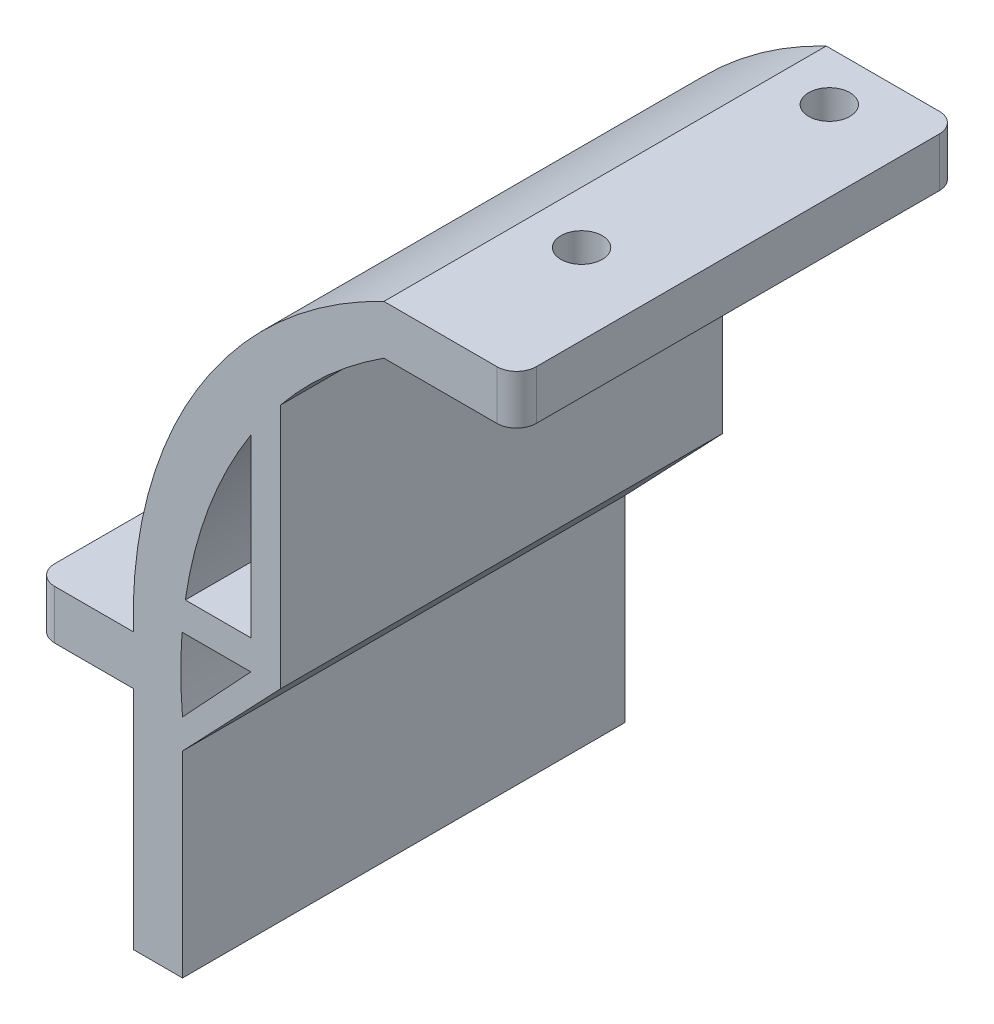
ISO-10303-21;
HEADER;
FILE_DESCRIPTION(('STEP AP214'),'2;1');
FILE_NAME('part.step','',(''),(''),'','','');
FILE_SCHEMA(('AUTOMOTIVE_DESIGN { 1 0 10303 214 1 1 1 1 }'));
ENDSEC;
DATA;
#1=APPLICATION_CONTEXT('core data for automotive mechanical design processes');
#2=APPLICATION_PROTOCOL_DEFINITION('international standard','automotive_design',2000,#1);
#3=PRODUCT_CONTEXT('',#1,'mechanical');
#4=PRODUCT('Part','Part','',(#3));
#5=PRODUCT_RELATED_PRODUCT_CATEGORY('part','',(#4));
#6=PRODUCT_DEFINITION_FORMATION('','',#4);
#7=PRODUCT_DEFINITION_CONTEXT('part definition',#1,'design');
#8=PRODUCT_DEFINITION('design','',#6,#7);
#9=PRODUCT_DEFINITION_SHAPE('','',#8);
#10=(LENGTH_UNIT() NAMED_UNIT(*) SI_UNIT(.MILLI.,.METRE.));
#11=(NAMED_UNIT(*) PLANE_ANGLE_UNIT() SI_UNIT($,.RADIAN.));
#12=(NAMED_UNIT(*) SI_UNIT($,.STERADIAN.) SOLID_ANGLE_UNIT());
#13=UNCERTAINTY_MEASURE_WITH_UNIT(LENGTH_MEASURE(1.E-05),#10,'distance_accuracy_value','');
#14=(GEOMETRIC_REPRESENTATION_CONTEXT(3) GLOBAL_UNCERTAINTY_ASSIGNED_CONTEXT((#13)) GLOBAL_UNIT_ASSIGNED_CONTEXT((#10,
#11,#12)) REPRESENTATION_CONTEXT('',''));
#15=CARTESIAN_POINT('',(0.,0.,0.));
#16=DIRECTION('',(0.,0.,1.));
#17=DIRECTION('',(1.,0.,0.));
#18=AXIS2_PLACEMENT_3D('',#15,#16,#17);
#19=CARTESIAN_POINT('',(19.2704077275692,219.412639915224,45.));
#20=DIRECTION('',(0.,0.,-1.));
#21=DIRECTION('',(-1.,0.,0.));
#22=AXIS2_PLACEMENT_3D('',#19,#20,#21);
#23=CYLINDRICAL_SURFACE('',#22,45.);
#24=DIRECTION('',(0.,0.,1.));
#25=VECTOR('',#24,1.);
#26=CARTESIAN_POINT('',(-18.5973694260722,243.723778379767,0.));
#27=LINE('',#26,#25);
#28=CARTESIAN_POINT('',(-18.5973694260722,243.723778379767,0.));
#29=VERTEX_POINT('',#28);
#30=CARTESIAN_POINT('',(-18.5973694260722,243.723778379767,45.));
#31=VERTEX_POINT('',#30);
#32=EDGE_CURVE('E225',#29,#31,#27,.T.);
#33=ORIENTED_EDGE('',*,*,#32,.T.);
#34=CARTESIAN_POINT('',(19.2704077275692,219.412639915224,45.));
#35=DIRECTION('',(0.,0.,1.));
#36=DIRECTION('',(1.,0.,0.));
#37=AXIS2_PLACEMENT_3D('',#34,#35,#36);
#38=CIRCLE('',#37,45.);
#39=CARTESIAN_POINT('',(-25.2653617340679,225.859750776681,45.));
#40=VERTEX_POINT('',#39);
#41=EDGE_CURVE('E308',#31,#40,#38,.T.);
#42=ORIENTED_EDGE('',*,*,#41,.T.);
#43=DIRECTION('',(0.,0.,1.));
#44=VECTOR('',#43,1.);
#45=CARTESIAN_POINT('',(-25.2653617340679,225.859750776681,0.));
#46=LINE('',#45,#44);
#47=CARTESIAN_POINT('',(-25.2653617340679,225.859750776681,0.));
#48=VERTEX_POINT('',#47);
#49=EDGE_CURVE('E211',#48,#40,#46,.T.);
#50=ORIENTED_EDGE('',*,*,#49,.F.);
#51=CARTESIAN_POINT('',(19.2704077275692,219.412639915224,0.));
#52=DIRECTION('',(0.,0.,1.));
#53=DIRECTION('',(1.,0.,0.));
#54=AXIS2_PLACEMENT_3D('',#51,#52,#53);
#55=CIRCLE('',#54,45.);
#56=EDGE_CURVE('E220',#29,#48,#55,.T.);
#57=ORIENTED_EDGE('',*,*,#56,.F.);
#58=EDGE_LOOP('',(#33,#42,#50,#57));
#59=FACE_BOUND('',#58,.T.);
#60=ADVANCED_FACE('F41',(#59),#23,.F.);
#61=DIRECTION('',(0.,0.,1.));
#62=VECTOR('',#61,1.);
#63=CARTESIAN_POINT('',(-25.5973694260722,222.859750776681,0.));
#64=LINE('',#63,#62);
#65=CARTESIAN_POINT('',(-25.5973694260722,222.859750776681,0.));
#66=VERTEX_POINT('',#65);
#67=CARTESIAN_POINT('',(-25.5973694260722,222.859750776681,45.));
#68=VERTEX_POINT('',#67);
#69=EDGE_CURVE('E273',#66,#68,#64,.T.);
#70=ORIENTED_EDGE('',*,*,#69,.T.);
#71=CARTESIAN_POINT('',(-25.5516147708674,215.414352888303,45.));
#72=VERTEX_POINT('',#71);
#73=EDGE_CURVE('E309',#68,#72,#38,.T.);
#74=ORIENTED_EDGE('',*,*,#73,.T.);
#75=DIRECTION('',(0.,0.,-1.));
#76=VECTOR('',#75,1.);
#77=CARTESIAN_POINT('',(-25.5516147708674,215.414352888303,45.));
#78=LINE('',#77,#76);
#79=CARTESIAN_POINT('',(-25.5516147708674,215.414352888303,0.));
#80=VERTEX_POINT('',#79);
#81=EDGE_CURVE('E335',#72,#80,#78,.T.);
#82=ORIENTED_EDGE('',*,*,#81,.T.);
#83=EDGE_CURVE('E341',#66,#80,#55,.T.);
#84=ORIENTED_EDGE('',*,*,#83,.F.);
#85=EDGE_LOOP('',(#70,#74,#82,#84));
#86=FACE_BOUND('',#85,.T.);
#87=ADVANCED_FACE('F485',(#86),#23,.F.);
#88=CARTESIAN_POINT('',(-25.5516147708674,0.,45.));
#89=DIRECTION('',(1.,0.,0.));
#90=DIRECTION('',(0.,0.,-1.));
#91=AXIS2_PLACEMENT_3D('',#88,#89,#90);
#92=PLANE('',#91);
#93=DIRECTION('',(0.,-1.,0.));
#94=VECTOR('',#93,1.);
#95=CARTESIAN_POINT('',(-25.5516147708674,0.,0.));
#96=LINE('',#95,#94);
#97=CARTESIAN_POINT('',(-25.5516147708674,212.414352888303,0.));
#98=VERTEX_POINT('',#97);
#99=CARTESIAN_POINT('',(-25.5516147708674,192.414352888303,0.));
#100=VERTEX_POINT('',#99);
#101=EDGE_CURVE('E364',#98,#100,#96,.T.);
#102=ORIENTED_EDGE('',*,*,#101,.F.);
#103=DIRECTION('',(0.,0.,1.));
#104=VECTOR('',#103,1.);
#105=CARTESIAN_POINT('',(-25.5516147708674,212.414352888303,0.));
#106=LINE('',#105,#104);
#107=CARTESIAN_POINT('',(-25.5516147708674,212.414352888303,45.));
#108=VERTEX_POINT('',#107);
#109=EDGE_CURVE('E59',#98,#108,#106,.T.);
#110=ORIENTED_EDGE('',*,*,#109,.T.);
#111=DIRECTION('',(0.,-1.,0.));
#112=VECTOR('',#111,1.);
#113=CARTESIAN_POINT('',(-25.5516147708674,0.,45.));
#114=LINE('',#113,#112);
#115=CARTESIAN_POINT('',(-25.5516147708674,192.414352888303,45.));
#116=VERTEX_POINT('',#115);
#117=EDGE_CURVE('E332',#108,#116,#114,.T.);
#118=ORIENTED_EDGE('',*,*,#117,.T.);
#119=DIRECTION('',(0.,0.,-1.));
#120=VECTOR('',#119,1.);
#121=CARTESIAN_POINT('',(-25.5516147708674,192.414352888303,45.));
#122=LINE('',#121,#120);
#123=EDGE_CURVE('E370',#116,#100,#122,.T.);
#124=ORIENTED_EDGE('',*,*,#123,.T.);
#125=EDGE_LOOP('',(#102,#110,#118,#124));
#126=FACE_BOUND('',#125,.T.);
#127=ADVANCED_FACE('F506',(#126),#92,.T.);
#128=DIRECTION('',(0.,0.,1.));
#129=VECTOR('',#128,1.);
#130=CARTESIAN_POINT('',(-15.5973694260722,247.859750776681,0.));
#131=LINE('',#130,#129);
#132=CARTESIAN_POINT('',(-15.5973694260722,247.859750776681,0.));
#133=VERTEX_POINT('',#132);
#134=CARTESIAN_POINT('',(-15.5973694260722,247.859750776681,45.));
#135=VERTEX_POINT('',#134);
#136=EDGE_CURVE('E262',#133,#135,#131,.T.);
#137=ORIENTED_EDGE('',*,*,#136,.F.);
#138=CARTESIAN_POINT('',(-5.06519953005821,257.264696918807,0.));
#139=VERTEX_POINT('',#138);
#140=EDGE_CURVE('E336',#139,#133,#55,.T.);
#141=ORIENTED_EDGE('',*,*,#140,.F.);
#142=DIRECTION('',(0.,0.,-1.));
#143=VECTOR('',#142,1.);
#144=CARTESIAN_POINT('',(-5.06519953005821,257.264696918807,45.));
#145=LINE('',#144,#143);
#146=CARTESIAN_POINT('',(-5.06519953005821,257.264696918807,45.));
#147=VERTEX_POINT('',#146);
#148=EDGE_CURVE('E406',#147,#139,#145,.T.);
#149=ORIENTED_EDGE('',*,*,#148,.F.);
#150=EDGE_CURVE('E303',#147,#135,#38,.T.);
#151=ORIENTED_EDGE('',*,*,#150,.T.);
#152=EDGE_LOOP('',(#137,#141,#149,#151));
#153=FACE_BOUND('',#152,.T.);
#154=ADVANCED_FACE('F502',(#153),#23,.F.);
#155=CARTESIAN_POINT('',(0.,257.264696918807,45.));
#156=DIRECTION('',(0.,-1.,0.));
#157=DIRECTION('',(0.,0.,-1.));
#158=AXIS2_PLACEMENT_3D('',#155,#156,#157);
#159=PLANE('',#158);
#160=CARTESIAN_POINT('',(0.244800469941791,257.264696918807,5.));
#161=DIRECTION('',(0.,-1.,0.));
#162=DIRECTION('',(0.,0.,-1.));
#163=AXIS2_PLACEMENT_3D('',#160,#161,#162);
#164=CIRCLE('',#163,2.1);
#165=CARTESIAN_POINT('',(0.244800469941791,257.264696918807,2.9));
#166=VERTEX_POINT('',#165);
#167=EDGE_CURVE('E290',#166,#166,#164,.T.);
#168=ORIENTED_EDGE('',*,*,#167,.F.);
#169=EDGE_LOOP('',(#168));
#170=FACE_BOUND('',#169,.T.);
#171=CARTESIAN_POINT('',(0.244800469941791,257.264696918807,30.2));
#172=DIRECTION('',(0.,-1.,0.));
#173=DIRECTION('',(0.,0.,-1.));
#174=AXIS2_PLACEMENT_3D('',#171,#172,#173);
#175=CIRCLE('',#174,2.1);
#176=CARTESIAN_POINT('',(0.244800469941791,257.264696918807,28.1));
#177=VERTEX_POINT('',#176);
#178=EDGE_CURVE('E283',#177,#177,#175,.T.);
#179=ORIENTED_EDGE('',*,*,#178,.F.);
#180=EDGE_LOOP('',(#179));
#181=FACE_BOUND('',#180,.T.);
#182=DIRECTION('',(-1.,0.,0.));
#183=VECTOR('',#182,1.);
#184=CARTESIAN_POINT('',(0.,257.264696918807,0.));
#185=LINE('',#184,#183);
#186=CARTESIAN_POINT('',(6.43480046994179,257.264696918807,0.));
#187=VERTEX_POINT('',#186);
#188=EDGE_CURVE('E340',#187,#139,#185,.T.);
#189=ORIENTED_EDGE('',*,*,#188,.F.);
#190=CARTESIAN_POINT('',(6.43480046994179,257.264696918807,2.));
#191=DIRECTION('',(0.,-1.,0.));
#192=DIRECTION('',(0.,0.,-1.));
#193=AXIS2_PLACEMENT_3D('',#190,#191,#192);
#194=CIRCLE('',#193,2.);
#195=CARTESIAN_POINT('',(8.43480046994179,257.264696918807,2.00000000000002));
#196=VERTEX_POINT('',#195);
#197=EDGE_CURVE('E446',#187,#196,#194,.T.);
#198=ORIENTED_EDGE('',*,*,#197,.T.);
#199=DIRECTION('',(0.,0.,-1.));
#200=VECTOR('',#199,1.);
#201=CARTESIAN_POINT('',(8.43480046994179,257.264696918807,45.));
#202=LINE('',#201,#200);
#203=CARTESIAN_POINT('',(8.43480046994179,257.264696918807,43.));
#204=VERTEX_POINT('',#203);
#205=EDGE_CURVE('E402',#204,#196,#202,.T.);
#206=ORIENTED_EDGE('',*,*,#205,.F.);
#207=CARTESIAN_POINT('',(6.43480046994179,257.264696918807,43.));
#208=DIRECTION('',(0.,-1.,0.));
#209=DIRECTION('',(0.,0.,-1.));
#210=AXIS2_PLACEMENT_3D('',#207,#208,#209);
#211=CIRCLE('',#210,2.);
#212=CARTESIAN_POINT('',(6.43480046994179,257.264696918807,45.));
#213=VERTEX_POINT('',#212);
#214=EDGE_CURVE('E443',#204,#213,#211,.T.);
#215=ORIENTED_EDGE('',*,*,#214,.T.);
#216=DIRECTION('',(-1.,0.,0.));
#217=VECTOR('',#216,1.);
#218=CARTESIAN_POINT('',(0.,257.264696918807,45.));
#219=LINE('',#218,#217);
#220=EDGE_CURVE('E307',#213,#147,#219,.T.);
#221=ORIENTED_EDGE('',*,*,#220,.T.);
#222=ORIENTED_EDGE('',*,*,#148,.T.);
#223=EDGE_LOOP('',(#189,#198,#206,#215,#221,#222));
#224=FACE_BOUND('',#223,.T.);
#225=ADVANCED_FACE('F509',(#170,#181,#224),#159,.T.);
#226=CARTESIAN_POINT('',(8.43480046994179,0.,45.));
#227=DIRECTION('',(1.,0.,0.));
#228=DIRECTION('',(0.,0.,-1.));
#229=AXIS2_PLACEMENT_3D('',#226,#227,#228);
#230=PLANE('',#229);
#231=ORIENTED_EDGE('',*,*,#205,.T.);
#232=DIRECTION('',(0.,-1.,0.));
#233=VECTOR('',#232,1.);
#234=CARTESIAN_POINT('',(8.43480046994179,262.264696918807,2.));
#235=LINE('',#234,#233);
#236=CARTESIAN_POINT('',(8.43480046994179,262.264696918807,2.00000000000002));
#237=VERTEX_POINT('',#236);
#238=EDGE_CURVE('E453',#196,#237,#235,.F.);
#239=ORIENTED_EDGE('',*,*,#238,.T.);
#240=DIRECTION('',(0.,0.,-1.));
#241=VECTOR('',#240,1.);
#242=CARTESIAN_POINT('',(8.43480046994179,262.264696918807,45.));
#243=LINE('',#242,#241);
#244=CARTESIAN_POINT('',(8.43480046994179,262.264696918807,43.));
#245=VERTEX_POINT('',#244);
#246=EDGE_CURVE('E398',#245,#237,#243,.T.);
#247=ORIENTED_EDGE('',*,*,#246,.F.);
#248=DIRECTION('',(0.,-1.,0.));
#249=VECTOR('',#248,1.);
#250=CARTESIAN_POINT('',(8.43480046994179,0.,43.));
#251=LINE('',#250,#249);
#252=EDGE_CURVE('E449',#245,#204,#251,.T.);
#253=ORIENTED_EDGE('',*,*,#252,.T.);
#254=EDGE_LOOP('',(#231,#239,#247,#253));
#255=FACE_BOUND('',#254,.T.);
#256=ADVANCED_FACE('F515',(#255),#230,.T.);
#257=CARTESIAN_POINT('',(0.,262.264696918807,45.));
#258=DIRECTION('',(0.,-1.,0.));
#259=DIRECTION('',(0.,0.,-1.));
#260=AXIS2_PLACEMENT_3D('',#257,#258,#259);
#261=PLANE('',#260);
#262=CARTESIAN_POINT('',(0.244800469941791,262.264696918807,5.));
#263=DIRECTION('',(0.,1.,0.));
#264=DIRECTION('',(0.,0.,1.));
#265=AXIS2_PLACEMENT_3D('',#262,#263,#264);
#266=CIRCLE('',#265,2.1);
#267=CARTESIAN_POINT('',(0.244800469941791,262.264696918807,7.1));
#268=VERTEX_POINT('',#267);
#269=EDGE_CURVE('E279',#268,#268,#266,.T.);
#270=ORIENTED_EDGE('',*,*,#269,.F.);
#271=EDGE_LOOP('',(#270));
#272=FACE_BOUND('',#271,.T.);
#273=CARTESIAN_POINT('',(0.244800469941791,262.264696918807,30.2));
#274=DIRECTION('',(0.,1.,0.));
#275=DIRECTION('',(0.,0.,1.));
#276=AXIS2_PLACEMENT_3D('',#273,#274,#275);
#277=CIRCLE('',#276,2.1);
#278=CARTESIAN_POINT('',(0.244800469941791,262.264696918807,32.3));
#279=VERTEX_POINT('',#278);
#280=EDGE_CURVE('E261',#279,#279,#277,.T.);
#281=ORIENTED_EDGE('',*,*,#280,.F.);
#282=EDGE_LOOP('',(#281));
#283=FACE_BOUND('',#282,.T.);
#284=ORIENTED_EDGE('',*,*,#246,.T.);
#285=CARTESIAN_POINT('',(6.43480046994179,262.264696918807,2.));
#286=DIRECTION('',(0.,-1.,0.));
#287=DIRECTION('',(0.,0.,-1.));
#288=AXIS2_PLACEMENT_3D('',#285,#286,#287);
#289=CIRCLE('',#288,2.);
#290=CARTESIAN_POINT('',(6.43480046994179,262.264696918807,0.));
#291=VERTEX_POINT('',#290);
#292=EDGE_CURVE('E11',#237,#291,#289,.F.);
#293=ORIENTED_EDGE('',*,*,#292,.T.);
#294=DIRECTION('',(-1.,0.,0.));
#295=VECTOR('',#294,1.);
#296=CARTESIAN_POINT('',(0.,262.264696918807,0.));
#297=LINE('',#296,#295);
#298=CARTESIAN_POINT('',(-5.06519953005821,262.264696918807,0.));
#299=VERTEX_POINT('',#298);
#300=EDGE_CURVE('E344',#291,#299,#297,.T.);
#301=ORIENTED_EDGE('',*,*,#300,.T.);
#302=DIRECTION('',(0.,0.,-1.));
#303=VECTOR('',#302,1.);
#304=CARTESIAN_POINT('',(-5.06519953005821,262.264696918807,45.));
#305=LINE('',#304,#303);
#306=CARTESIAN_POINT('',(-5.06519953005821,262.264696918807,45.));
#307=VERTEX_POINT('',#306);
#308=EDGE_CURVE('E394',#307,#299,#305,.T.);
#309=ORIENTED_EDGE('',*,*,#308,.F.);
#310=DIRECTION('',(-1.,0.,0.));
#311=VECTOR('',#310,1.);
#312=CARTESIAN_POINT('',(0.,262.264696918807,45.));
#313=LINE('',#312,#311);
#314=CARTESIAN_POINT('',(6.43480046994179,262.264696918807,45.));
#315=VERTEX_POINT('',#314);
#316=EDGE_CURVE('E312',#315,#307,#313,.T.);
#317=ORIENTED_EDGE('',*,*,#316,.F.);
#318=CARTESIAN_POINT('',(6.43480046994179,262.264696918807,43.));
#319=DIRECTION('',(0.,-1.,0.));
#320=DIRECTION('',(0.,0.,-1.));
#321=AXIS2_PLACEMENT_3D('',#318,#319,#320);
#322=CIRCLE('',#321,2.);
#323=EDGE_CURVE('E51',#315,#245,#322,.F.);
#324=ORIENTED_EDGE('',*,*,#323,.T.);
#325=EDGE_LOOP('',(#284,#293,#301,#309,#317,#324));
#326=FACE_BOUND('',#325,.T.);
#327=ADVANCED_FACE('F579',(#272,#283,#326),#261,.F.);
#328=CARTESIAN_POINT('',(14.4298215899234,221.70678583439,45.));
#329=DIRECTION('',(0.,0.,-1.));
#330=DIRECTION('',(-1.,0.,0.));
#331=AXIS2_PLACEMENT_3D('',#328,#329,#330);
#332=CYLINDRICAL_SURFACE('',#331,45.);
#333=CARTESIAN_POINT('',(14.4298215899234,221.70678583439,0.));
#334=DIRECTION('',(0.,0.,1.));
#335=DIRECTION('',(1.,0.,0.));
#336=AXIS2_PLACEMENT_3D('',#333,#334,#335);
#337=CIRCLE('',#336,45.);
#338=CARTESIAN_POINT('',(-30.5516147708674,220.414352888303,0.));
#339=VERTEX_POINT('',#338);
#340=EDGE_CURVE('E347',#339,#299,#337,.F.);
#341=ORIENTED_EDGE('',*,*,#340,.F.);
#342=DIRECTION('',(0.,0.,-1.));
#343=VECTOR('',#342,1.);
#344=CARTESIAN_POINT('',(-30.5516147708674,220.414352888303,45.));
#345=LINE('',#344,#343);
#346=CARTESIAN_POINT('',(-30.5516147708674,220.414352888303,45.));
#347=VERTEX_POINT('',#346);
#348=EDGE_CURVE('E390',#347,#339,#345,.T.);
#349=ORIENTED_EDGE('',*,*,#348,.F.);
#350=CARTESIAN_POINT('',(14.4298215899234,221.70678583439,45.));
#351=DIRECTION('',(0.,0.,1.));
#352=DIRECTION('',(1.,0.,0.));
#353=AXIS2_PLACEMENT_3D('',#350,#351,#352);
#354=CIRCLE('',#353,45.);
#355=EDGE_CURVE('E315',#347,#307,#354,.F.);
#356=ORIENTED_EDGE('',*,*,#355,.T.);
#357=ORIENTED_EDGE('',*,*,#308,.T.);
#358=EDGE_LOOP('',(#341,#349,#356,#357));
#359=FACE_BOUND('',#358,.T.);
#360=ADVANCED_FACE('F565',(#359),#332,.T.);
#361=CARTESIAN_POINT('',(0.,220.414352888303,45.));
#362=DIRECTION('',(0.,1.,0.));
#363=DIRECTION('',(0.,0.,1.));
#364=AXIS2_PLACEMENT_3D('',#361,#362,#363);
#365=PLANE('',#364);
#366=CARTESIAN_POINT('',(-35.5516147708674,220.414352888303,10.));
#367=DIRECTION('',(0.,1.,0.));
#368=DIRECTION('',(0.,0.,1.));
#369=AXIS2_PLACEMENT_3D('',#366,#367,#368);
#370=CIRCLE('',#369,2.1);
#371=CARTESIAN_POINT('',(-35.5516147708674,220.414352888303,12.1));
#372=VERTEX_POINT('',#371);
#373=EDGE_CURVE('E295',#372,#372,#370,.T.);
#374=ORIENTED_EDGE('',*,*,#373,.F.);
#375=EDGE_LOOP('',(#374));
#376=FACE_BOUND('',#375,.T.);
#377=CARTESIAN_POINT('',(-35.5516147708674,220.414352888303,35.));
#378=DIRECTION('',(0.,1.,0.));
#379=DIRECTION('',(0.,0.,1.));
#380=AXIS2_PLACEMENT_3D('',#377,#378,#379);
#381=CIRCLE('',#380,2.1);
#382=CARTESIAN_POINT('',(-35.5516147708674,220.414352888303,37.1));
#383=VERTEX_POINT('',#382);
#384=EDGE_CURVE('E294',#383,#383,#381,.T.);
#385=ORIENTED_EDGE('',*,*,#384,.F.);
#386=EDGE_LOOP('',(#385));
#387=FACE_BOUND('',#386,.T.);
#388=DIRECTION('',(0.,0.,-1.));
#389=VECTOR('',#388,1.);
#390=CARTESIAN_POINT('',(-40.5516147708674,220.414352888303,45.));
#391=LINE('',#390,#389);
#392=CARTESIAN_POINT('',(-40.5516147708674,220.414352888303,43.));
#393=VERTEX_POINT('',#392);
#394=CARTESIAN_POINT('',(-40.5516147708674,220.414352888303,2.00000000000002));
#395=VERTEX_POINT('',#394);
#396=EDGE_CURVE('E386',#393,#395,#391,.T.);
#397=ORIENTED_EDGE('',*,*,#396,.F.);
#398=CARTESIAN_POINT('',(-38.5516147708674,220.414352888303,43.));
#399=DIRECTION('',(0.,1.,0.));
#400=DIRECTION('',(0.,0.,1.));
#401=AXIS2_PLACEMENT_3D('',#398,#399,#400);
#402=CIRCLE('',#401,2.);
#403=CARTESIAN_POINT('',(-38.5516147708674,220.414352888303,45.));
#404=VERTEX_POINT('',#403);
#405=EDGE_CURVE('E420',#393,#404,#402,.T.);
#406=ORIENTED_EDGE('',*,*,#405,.T.);
#407=DIRECTION('',(1.,0.,0.));
#408=VECTOR('',#407,1.);
#409=CARTESIAN_POINT('',(0.,220.414352888303,45.));
#410=LINE('',#409,#408);
#411=EDGE_CURVE('E319',#404,#347,#410,.T.);
#412=ORIENTED_EDGE('',*,*,#411,.T.);
#413=ORIENTED_EDGE('',*,*,#348,.T.);
#414=DIRECTION('',(1.,0.,0.));
#415=VECTOR('',#414,1.);
#416=CARTESIAN_POINT('',(0.,220.414352888303,0.));
#417=LINE('',#416,#415);
#418=CARTESIAN_POINT('',(-38.5516147708674,220.414352888303,0.));
#419=VERTEX_POINT('',#418);
#420=EDGE_CURVE('E351',#419,#339,#417,.T.);
#421=ORIENTED_EDGE('',*,*,#420,.F.);
#422=CARTESIAN_POINT('',(-38.5516147708674,220.414352888303,2.));
#423=DIRECTION('',(0.,1.,0.));
#424=DIRECTION('',(0.,0.,1.));
#425=AXIS2_PLACEMENT_3D('',#422,#423,#424);
#426=CIRCLE('',#425,2.);
#427=EDGE_CURVE('E417',#419,#395,#426,.T.);
#428=ORIENTED_EDGE('',*,*,#427,.T.);
#429=EDGE_LOOP('',(#397,#406,#412,#413,#421,#428));
#430=FACE_BOUND('',#429,.T.);
#431=ADVANCED_FACE('F559',(#376,#387,#430),#365,.T.);
#432=CARTESIAN_POINT('',(-40.5516147708674,0.,45.));
#433=DIRECTION('',(-1.,0.,0.));
#434=DIRECTION('',(0.,0.,1.));
#435=AXIS2_PLACEMENT_3D('',#432,#433,#434);
#436=PLANE('',#435);
#437=DIRECTION('',(0.,0.,-1.));
#438=VECTOR('',#437,1.);
#439=CARTESIAN_POINT('',(-40.5516147708674,215.414352888303,45.));
#440=LINE('',#439,#438);
#441=CARTESIAN_POINT('',(-40.5516147708674,215.414352888303,43.));
#442=VERTEX_POINT('',#441);
#443=CARTESIAN_POINT('',(-40.5516147708674,215.414352888303,2.00000000000002));
#444=VERTEX_POINT('',#443);
#445=EDGE_CURVE('E382',#442,#444,#440,.T.);
#446=ORIENTED_EDGE('',*,*,#445,.F.);
#447=DIRECTION('',(0.,1.,0.));
#448=VECTOR('',#447,1.);
#449=CARTESIAN_POINT('',(-40.5516147708674,0.,43.));
#450=LINE('',#449,#448);
#451=EDGE_CURVE('E413',#442,#393,#450,.T.);
#452=ORIENTED_EDGE('',*,*,#451,.T.);
#453=ORIENTED_EDGE('',*,*,#396,.T.);
#454=DIRECTION('',(0.,1.,0.));
#455=VECTOR('',#454,1.);
#456=CARTESIAN_POINT('',(-40.5516147708674,215.414352888303,2.));
#457=LINE('',#456,#455);
#458=EDGE_CURVE('E410',#395,#444,#457,.F.);
#459=ORIENTED_EDGE('',*,*,#458,.T.);
#460=EDGE_LOOP('',(#446,#452,#453,#459));
#461=FACE_BOUND('',#460,.T.);
#462=ADVANCED_FACE('F583',(#461),#436,.T.);
#463=CARTESIAN_POINT('',(0.,215.414352888303,45.));
#464=DIRECTION('',(0.,1.,0.));
#465=DIRECTION('',(0.,0.,1.));
#466=AXIS2_PLACEMENT_3D('',#463,#464,#465);
#467=PLANE('',#466);
#468=CARTESIAN_POINT('',(-35.5516147708674,215.414352888303,10.));
#469=DIRECTION('',(0.,1.,0.));
#470=DIRECTION('',(0.,0.,1.));
#471=AXIS2_PLACEMENT_3D('',#468,#469,#470);
#472=CIRCLE('',#471,2.1);
#473=CARTESIAN_POINT('',(-35.5516147708674,215.414352888303,12.1));
#474=VERTEX_POINT('',#473);
#475=EDGE_CURVE('E45',#474,#474,#472,.T.);
#476=ORIENTED_EDGE('',*,*,#475,.T.);
#477=EDGE_LOOP('',(#476));
#478=FACE_BOUND('',#477,.T.);
#479=CARTESIAN_POINT('',(-35.5516147708674,215.414352888303,35.));
#480=DIRECTION('',(0.,1.,0.));
#481=DIRECTION('',(0.,0.,1.));
#482=AXIS2_PLACEMENT_3D('',#479,#480,#481);
#483=CIRCLE('',#482,2.1);
#484=CARTESIAN_POINT('',(-35.5516147708674,215.414352888303,37.1));
#485=VERTEX_POINT('',#484);
#486=EDGE_CURVE('E299',#485,#485,#483,.T.);
#487=ORIENTED_EDGE('',*,*,#486,.T.);
#488=EDGE_LOOP('',(#487));
#489=FACE_BOUND('',#488,.T.);
#490=DIRECTION('',(1.,0.,0.));
#491=VECTOR('',#490,1.);
#492=CARTESIAN_POINT('',(0.,215.414352888303,45.));
#493=LINE('',#492,#491);
#494=CARTESIAN_POINT('',(-38.5516147708674,215.414352888303,45.));
#495=VERTEX_POINT('',#494);
#496=CARTESIAN_POINT('',(-30.5516147708674,215.414352888303,45.));
#497=VERTEX_POINT('',#496);
#498=EDGE_CURVE('E322',#495,#497,#493,.T.);
#499=ORIENTED_EDGE('',*,*,#498,.F.);
#500=CARTESIAN_POINT('',(-38.5516147708674,215.414352888303,43.));
#501=DIRECTION('',(0.,1.,0.));
#502=DIRECTION('',(0.,0.,1.));
#503=AXIS2_PLACEMENT_3D('',#500,#501,#502);
#504=CIRCLE('',#503,2.);
#505=EDGE_CURVE('E432',#495,#442,#504,.F.);
#506=ORIENTED_EDGE('',*,*,#505,.T.);
#507=ORIENTED_EDGE('',*,*,#445,.T.);
#508=CARTESIAN_POINT('',(-38.5516147708674,215.414352888303,2.));
#509=DIRECTION('',(0.,1.,0.));
#510=DIRECTION('',(0.,0.,1.));
#511=AXIS2_PLACEMENT_3D('',#508,#509,#510);
#512=CIRCLE('',#511,2.);
#513=CARTESIAN_POINT('',(-38.5516147708674,215.414352888303,0.));
#514=VERTEX_POINT('',#513);
#515=EDGE_CURVE('E429',#444,#514,#512,.F.);
#516=ORIENTED_EDGE('',*,*,#515,.T.);
#517=DIRECTION('',(1.,0.,0.));
#518=VECTOR('',#517,1.);
#519=CARTESIAN_POINT('',(0.,215.414352888303,0.));
#520=LINE('',#519,#518);
#521=CARTESIAN_POINT('',(-30.5516147708674,215.414352888303,0.));
#522=VERTEX_POINT('',#521);
#523=EDGE_CURVE('E354',#514,#522,#520,.T.);
#524=ORIENTED_EDGE('',*,*,#523,.T.);
#525=DIRECTION('',(0.,0.,-1.));
#526=VECTOR('',#525,1.);
#527=CARTESIAN_POINT('',(-30.5516147708674,215.414352888303,45.));
#528=LINE('',#527,#526);
#529=EDGE_CURVE('E378',#497,#522,#528,.T.);
#530=ORIENTED_EDGE('',*,*,#529,.F.);
#531=EDGE_LOOP('',(#499,#506,#507,#516,#524,#530));
#532=FACE_BOUND('',#531,.T.);
#533=ADVANCED_FACE('F550',(#478,#489,#532),#467,.F.);
#534=CARTESIAN_POINT('',(-30.5516147708674,0.,45.));
#535=DIRECTION('',(1.,0.,0.));
#536=DIRECTION('',(0.,0.,-1.));
#537=AXIS2_PLACEMENT_3D('',#534,#535,#536);
#538=PLANE('',#537);
#539=DIRECTION('',(0.,-1.,0.));
#540=VECTOR('',#539,1.);
#541=CARTESIAN_POINT('',(-30.5516147708674,0.,0.));
#542=LINE('',#541,#540);
#543=CARTESIAN_POINT('',(-30.5516147708674,192.414352888303,0.));
#544=VERTEX_POINT('',#543);
#545=EDGE_CURVE('E357',#522,#544,#542,.T.);
#546=ORIENTED_EDGE('',*,*,#545,.T.);
#547=DIRECTION('',(0.,0.,-1.));
#548=VECTOR('',#547,1.);
#549=CARTESIAN_POINT('',(-30.5516147708674,192.414352888303,45.));
#550=LINE('',#549,#548);
#551=CARTESIAN_POINT('',(-30.5516147708674,192.414352888303,45.));
#552=VERTEX_POINT('',#551);
#553=EDGE_CURVE('E374',#552,#544,#550,.T.);
#554=ORIENTED_EDGE('',*,*,#553,.F.);
#555=DIRECTION('',(0.,-1.,0.));
#556=VECTOR('',#555,1.);
#557=CARTESIAN_POINT('',(-30.5516147708674,0.,45.));
#558=LINE('',#557,#556);
#559=EDGE_CURVE('E325',#497,#552,#558,.T.);
#560=ORIENTED_EDGE('',*,*,#559,.F.);
#561=ORIENTED_EDGE('',*,*,#529,.T.);
#562=EDGE_LOOP('',(#546,#554,#560,#561));
#563=FACE_BOUND('',#562,.T.);
#564=ADVANCED_FACE('F545',(#563),#538,.F.);
#565=CARTESIAN_POINT('',(0.,192.414352888303,45.));
#566=DIRECTION('',(0.,1.,0.));
#567=DIRECTION('',(0.,0.,1.));
#568=AXIS2_PLACEMENT_3D('',#565,#566,#567);
#569=PLANE('',#568);
#570=DIRECTION('',(1.,0.,0.));
#571=VECTOR('',#570,1.);
#572=CARTESIAN_POINT('',(0.,192.414352888303,0.));
#573=LINE('',#572,#571);
#574=EDGE_CURVE('E360',#544,#100,#573,.T.);
#575=ORIENTED_EDGE('',*,*,#574,.T.);
#576=ORIENTED_EDGE('',*,*,#123,.F.);
#577=DIRECTION('',(1.,0.,0.));
#578=VECTOR('',#577,1.);
#579=CARTESIAN_POINT('',(0.,192.414352888303,45.));
#580=LINE('',#579,#578);
#581=EDGE_CURVE('E328',#552,#116,#580,.T.);
#582=ORIENTED_EDGE('',*,*,#581,.F.);
#583=ORIENTED_EDGE('',*,*,#553,.T.);
#584=EDGE_LOOP('',(#575,#576,#582,#583));
#585=FACE_BOUND('',#584,.T.);
#586=ADVANCED_FACE('F478',(#585),#569,.F.);
#587=CARTESIAN_POINT('',(0.,0.,45.));
#588=DIRECTION('',(0.,0.,1.));
#589=DIRECTION('',(1.,0.,0.));
#590=AXIS2_PLACEMENT_3D('',#587,#588,#589);
#591=PLANE('',#590);
#592=DIRECTION('',(0.,1.,0.));
#593=VECTOR('',#592,1.);
#594=CARTESIAN_POINT('',(-15.5973694260722,0.,45.));
#595=LINE('',#594,#593);
#596=CARTESIAN_POINT('',(-15.5973694260722,222.859750776681,45.));
#597=VERTEX_POINT('',#596);
#598=EDGE_CURVE('E227',#597,#135,#595,.T.);
#599=ORIENTED_EDGE('',*,*,#598,.T.);
#600=ORIENTED_EDGE('',*,*,#150,.F.);
#601=ORIENTED_EDGE('',*,*,#220,.F.);
#602=DIRECTION('',(0.,-1.,0.));
#603=VECTOR('',#602,1.);
#604=CARTESIAN_POINT('',(6.43480046994179,0.,45.));
#605=LINE('',#604,#603);
#606=EDGE_CURVE('E423',#213,#315,#605,.F.);
#607=ORIENTED_EDGE('',*,*,#606,.T.);
#608=ORIENTED_EDGE('',*,*,#316,.T.);
#609=ORIENTED_EDGE('',*,*,#355,.F.);
#610=ORIENTED_EDGE('',*,*,#411,.F.);
#611=DIRECTION('',(0.,1.,0.));
#612=VECTOR('',#611,1.);
#613=CARTESIAN_POINT('',(-38.5516147708674,0.,45.));
#614=LINE('',#613,#612);
#615=EDGE_CURVE('E426',#404,#495,#614,.F.);
#616=ORIENTED_EDGE('',*,*,#615,.T.);
#617=ORIENTED_EDGE('',*,*,#498,.T.);
#618=ORIENTED_EDGE('',*,*,#559,.T.);
#619=ORIENTED_EDGE('',*,*,#581,.T.);
#620=ORIENTED_EDGE('',*,*,#117,.F.);
#621=DIRECTION('',(-0.68988218010904,-0.723921665353371,0.));
#622=VECTOR('',#621,1.);
#623=CARTESIAN_POINT('',(-119.474760714532,113.856943830399,45.));
#624=LINE('',#623,#622);
#625=EDGE_CURVE('E231',#597,#108,#624,.T.);
#626=ORIENTED_EDGE('',*,*,#625,.F.);
#627=EDGE_LOOP('',(#599,#600,#601,#607,#608,#609,#610,#616,#617,#618,#619,#620,#626));
#628=FACE_BOUND('',#627,.T.);
#629=ORIENTED_EDGE('',*,*,#41,.F.);
#630=DIRECTION('',(0.,-1.,0.));
#631=VECTOR('',#630,1.);
#632=CARTESIAN_POINT('',(-18.5973694260721,0.,45.));
#633=LINE('',#632,#631);
#634=CARTESIAN_POINT('',(-18.5973694260722,225.859750776681,45.));
#635=VERTEX_POINT('',#634);
#636=EDGE_CURVE('E244',#31,#635,#633,.T.);
#637=ORIENTED_EDGE('',*,*,#636,.T.);
#638=DIRECTION('',(-1.,0.,0.));
#639=VECTOR('',#638,1.);
#640=CARTESIAN_POINT('',(0.,225.859750776681,45.));
#641=LINE('',#640,#639);
#642=EDGE_CURVE('E206',#635,#40,#641,.T.);
#643=ORIENTED_EDGE('',*,*,#642,.T.);
#644=EDGE_LOOP('',(#629,#637,#643));
#645=FACE_BOUND('',#644,.T.);
#646=DIRECTION('',(-0.682591367762052,-0.730800263175056,0.));
#647=VECTOR('',#646,1.);
#648=CARTESIAN_POINT('',(-121.103180433286,113.114334706377,45.));
#649=LINE('',#648,#647);
#650=CARTESIAN_POINT('',(-18.5973694260722,222.859750776681,45.));
#651=VERTEX_POINT('',#650);
#652=EDGE_CURVE('E253',#651,#72,#649,.T.);
#653=ORIENTED_EDGE('',*,*,#652,.T.);
#654=ORIENTED_EDGE('',*,*,#73,.F.);
#655=DIRECTION('',(1.,0.,0.));
#656=VECTOR('',#655,1.);
#657=CARTESIAN_POINT('',(0.,222.859750776681,45.));
#658=LINE('',#657,#656);
#659=EDGE_CURVE('E249',#68,#651,#658,.T.);
#660=ORIENTED_EDGE('',*,*,#659,.T.);
#661=EDGE_LOOP('',(#653,#654,#660));
#662=FACE_BOUND('',#661,.T.);
#663=ADVANCED_FACE('F475',(#628,#645,#662),#591,.T.);
#664=CARTESIAN_POINT('',(0.,0.,0.));
#665=DIRECTION('',(0.,0.,1.));
#666=DIRECTION('',(1.,0.,0.));
#667=AXIS2_PLACEMENT_3D('',#664,#665,#666);
#668=PLANE('',#667);
#669=ORIENTED_EDGE('',*,*,#140,.T.);
#670=DIRECTION('',(0.,1.,0.));
#671=VECTOR('',#670,1.);
#672=CARTESIAN_POINT('',(-15.5973694260722,0.,0.));
#673=LINE('',#672,#671);
#674=CARTESIAN_POINT('',(-15.5973694260722,222.859750776681,0.));
#675=VERTEX_POINT('',#674);
#676=EDGE_CURVE('E212',#675,#133,#673,.T.);
#677=ORIENTED_EDGE('',*,*,#676,.F.);
#678=DIRECTION('',(-0.68988218010904,-0.723921665353371,0.));
#679=VECTOR('',#678,1.);
#680=CARTESIAN_POINT('',(-119.474760714532,113.856943830399,0.));
#681=LINE('',#680,#679);
#682=EDGE_CURVE('E239',#675,#98,#681,.T.);
#683=ORIENTED_EDGE('',*,*,#682,.T.);
#684=ORIENTED_EDGE('',*,*,#101,.T.);
#685=ORIENTED_EDGE('',*,*,#574,.F.);
#686=ORIENTED_EDGE('',*,*,#545,.F.);
#687=ORIENTED_EDGE('',*,*,#523,.F.);
#688=DIRECTION('',(0.,1.,0.));
#689=VECTOR('',#688,1.);
#690=CARTESIAN_POINT('',(-38.5516147708674,220.414352888303,0.));
#691=LINE('',#690,#689);
#692=EDGE_CURVE('E439',#514,#419,#691,.T.);
#693=ORIENTED_EDGE('',*,*,#692,.T.);
#694=ORIENTED_EDGE('',*,*,#420,.T.);
#695=ORIENTED_EDGE('',*,*,#340,.T.);
#696=ORIENTED_EDGE('',*,*,#300,.F.);
#697=DIRECTION('',(0.,-1.,0.));
#698=VECTOR('',#697,1.);
#699=CARTESIAN_POINT('',(6.43480046994179,257.264696918807,0.));
#700=LINE('',#699,#698);
#701=EDGE_CURVE('E435',#291,#187,#700,.T.);
#702=ORIENTED_EDGE('',*,*,#701,.T.);
#703=ORIENTED_EDGE('',*,*,#188,.T.);
#704=EDGE_LOOP('',(#669,#677,#683,#684,#685,#686,#687,#693,#694,#695,#696,#702,#703));
#705=FACE_BOUND('',#704,.T.);
#706=DIRECTION('',(0.,-1.,0.));
#707=VECTOR('',#706,1.);
#708=CARTESIAN_POINT('',(-18.5973694260721,0.,0.));
#709=LINE('',#708,#707);
#710=CARTESIAN_POINT('',(-18.5973694260722,225.859750776681,0.));
#711=VERTEX_POINT('',#710);
#712=EDGE_CURVE('E217',#29,#711,#709,.T.);
#713=ORIENTED_EDGE('',*,*,#712,.F.);
#714=ORIENTED_EDGE('',*,*,#56,.T.);
#715=DIRECTION('',(-1.,0.,0.));
#716=VECTOR('',#715,1.);
#717=CARTESIAN_POINT('',(0.,225.859750776681,0.));
#718=LINE('',#717,#716);
#719=EDGE_CURVE('E203',#711,#48,#718,.T.);
#720=ORIENTED_EDGE('',*,*,#719,.F.);
#721=EDGE_LOOP('',(#713,#714,#720));
#722=FACE_BOUND('',#721,.T.);
#723=ORIENTED_EDGE('',*,*,#83,.T.);
#724=DIRECTION('',(-0.682591367762052,-0.730800263175056,0.));
#725=VECTOR('',#724,1.);
#726=CARTESIAN_POINT('',(-121.103180433286,113.114334706377,0.));
#727=LINE('',#726,#725);
#728=CARTESIAN_POINT('',(-18.5973694260722,222.859750776681,0.));
#729=VERTEX_POINT('',#728);
#730=EDGE_CURVE('E236',#729,#80,#727,.T.);
#731=ORIENTED_EDGE('',*,*,#730,.F.);
#732=DIRECTION('',(1.,0.,0.));
#733=VECTOR('',#732,1.);
#734=CARTESIAN_POINT('',(0.,222.859750776681,0.));
#735=LINE('',#734,#733);
#736=EDGE_CURVE('E67',#66,#729,#735,.T.);
#737=ORIENTED_EDGE('',*,*,#736,.F.);
#738=EDGE_LOOP('',(#723,#731,#737));
#739=FACE_BOUND('',#738,.T.);
#740=ADVANCED_FACE('F216',(#705,#722,#739),#668,.F.);
#741=CARTESIAN_POINT('',(-38.5516147708674,0.,43.));
#742=DIRECTION('',(0.,1.,0.));
#743=DIRECTION('',(0.,0.,1.));
#744=AXIS2_PLACEMENT_3D('',#741,#742,#743);
#745=CYLINDRICAL_SURFACE('',#744,2.);
#746=ORIENTED_EDGE('',*,*,#505,.F.);
#747=ORIENTED_EDGE('',*,*,#615,.F.);
#748=ORIENTED_EDGE('',*,*,#405,.F.);
#749=ORIENTED_EDGE('',*,*,#451,.F.);
#750=EDGE_LOOP('',(#746,#747,#748,#749));
#751=FACE_BOUND('',#750,.T.);
#752=ADVANCED_FACE('F490',(#751),#745,.T.);
#753=CARTESIAN_POINT('',(-38.5516147708674,0.,2.));
#754=DIRECTION('',(0.,-1.,0.));
#755=DIRECTION('',(0.,0.,-1.));
#756=AXIS2_PLACEMENT_3D('',#753,#754,#755);
#757=CYLINDRICAL_SURFACE('',#756,2.);
#758=ORIENTED_EDGE('',*,*,#515,.F.);
#759=ORIENTED_EDGE('',*,*,#458,.F.);
#760=ORIENTED_EDGE('',*,*,#427,.F.);
#761=ORIENTED_EDGE('',*,*,#692,.F.);
#762=EDGE_LOOP('',(#758,#759,#760,#761));
#763=FACE_BOUND('',#762,.T.);
#764=ADVANCED_FACE('F496',(#763),#757,.T.);
#765=CARTESIAN_POINT('',(6.43480046994179,0.,2.));
#766=DIRECTION('',(0.,1.,0.));
#767=DIRECTION('',(0.,0.,1.));
#768=AXIS2_PLACEMENT_3D('',#765,#766,#767);
#769=CYLINDRICAL_SURFACE('',#768,2.);
#770=ORIENTED_EDGE('',*,*,#292,.F.);
#771=ORIENTED_EDGE('',*,*,#238,.F.);
#772=ORIENTED_EDGE('',*,*,#197,.F.);
#773=ORIENTED_EDGE('',*,*,#701,.F.);
#774=EDGE_LOOP('',(#770,#771,#772,#773));
#775=FACE_BOUND('',#774,.T.);
#776=ADVANCED_FACE('F570',(#775),#769,.T.);
#777=CARTESIAN_POINT('',(6.43480046994179,0.,43.));
#778=DIRECTION('',(0.,-1.,0.));
#779=DIRECTION('',(0.,0.,-1.));
#780=AXIS2_PLACEMENT_3D('',#777,#778,#779);
#781=CYLINDRICAL_SURFACE('',#780,2.);
#782=ORIENTED_EDGE('',*,*,#323,.F.);
#783=ORIENTED_EDGE('',*,*,#606,.F.);
#784=ORIENTED_EDGE('',*,*,#214,.F.);
#785=ORIENTED_EDGE('',*,*,#252,.F.);
#786=EDGE_LOOP('',(#782,#783,#784,#785));
#787=FACE_BOUND('',#786,.T.);
#788=ADVANCED_FACE('F43',(#787),#781,.T.);
#789=CARTESIAN_POINT('',(-35.5516147708674,175.414352888303,35.));
#790=DIRECTION('',(0.,1.,0.));
#791=DIRECTION('',(0.,0.,1.));
#792=AXIS2_PLACEMENT_3D('',#789,#790,#791);
#793=CYLINDRICAL_SURFACE('',#792,2.1);
#794=ORIENTED_EDGE('',*,*,#384,.T.);
#795=EDGE_LOOP('',(#794));
#796=FACE_BOUND('',#795,.T.);
#797=ORIENTED_EDGE('',*,*,#486,.F.);
#798=EDGE_LOOP('',(#797));
#799=FACE_BOUND('',#798,.T.);
#800=ADVANCED_FACE('F639',(#796,#799),#793,.F.);
#801=CARTESIAN_POINT('',(-35.5516147708674,175.414352888303,10.));
#802=DIRECTION('',(0.,1.,0.));
#803=DIRECTION('',(0.,0.,1.));
#804=AXIS2_PLACEMENT_3D('',#801,#802,#803);
#805=CYLINDRICAL_SURFACE('',#804,2.1);
#806=ORIENTED_EDGE('',*,*,#373,.T.);
#807=EDGE_LOOP('',(#806));
#808=FACE_BOUND('',#807,.T.);
#809=ORIENTED_EDGE('',*,*,#475,.F.);
#810=EDGE_LOOP('',(#809));
#811=FACE_BOUND('',#810,.T.);
#812=ADVANCED_FACE('F644',(#808,#811),#805,.F.);
#813=CARTESIAN_POINT('',(0.244800469941791,217.264696918807,30.2));
#814=DIRECTION('',(0.,1.,0.));
#815=DIRECTION('',(0.,0.,1.));
#816=AXIS2_PLACEMENT_3D('',#813,#814,#815);
#817=CYLINDRICAL_SURFACE('',#816,2.1);
#818=ORIENTED_EDGE('',*,*,#178,.T.);
#819=EDGE_LOOP('',(#818));
#820=FACE_BOUND('',#819,.T.);
#821=ORIENTED_EDGE('',*,*,#280,.T.);
#822=EDGE_LOOP('',(#821));
#823=FACE_BOUND('',#822,.T.);
#824=ADVANCED_FACE('F653',(#820,#823),#817,.F.);
#825=CARTESIAN_POINT('',(0.244800469941791,217.264696918807,5.));
#826=DIRECTION('',(0.,1.,0.));
#827=DIRECTION('',(0.,0.,1.));
#828=AXIS2_PLACEMENT_3D('',#825,#826,#827);
#829=CYLINDRICAL_SURFACE('',#828,2.1);
#830=ORIENTED_EDGE('',*,*,#167,.T.);
#831=EDGE_LOOP('',(#830));
#832=FACE_BOUND('',#831,.T.);
#833=ORIENTED_EDGE('',*,*,#269,.T.);
#834=EDGE_LOOP('',(#833));
#835=FACE_BOUND('',#834,.T.);
#836=ADVANCED_FACE('F677',(#832,#835),#829,.F.);
#837=CARTESIAN_POINT('',(-18.5973694260721,0.,0.));
#838=DIRECTION('',(-1.,0.,0.));
#839=DIRECTION('',(0.,-1.,0.));
#840=AXIS2_PLACEMENT_3D('',#837,#838,#839);
#841=PLANE('',#840);
#842=ORIENTED_EDGE('',*,*,#636,.F.);
#843=ORIENTED_EDGE('',*,*,#32,.F.);
#844=ORIENTED_EDGE('',*,*,#712,.T.);
#845=DIRECTION('',(0.,0.,1.));
#846=VECTOR('',#845,1.);
#847=CARTESIAN_POINT('',(-18.5973694260722,225.859750776681,0.));
#848=LINE('',#847,#846);
#849=EDGE_CURVE('E200',#711,#635,#848,.T.);
#850=ORIENTED_EDGE('',*,*,#849,.T.);
#851=EDGE_LOOP('',(#842,#843,#844,#850));
#852=FACE_BOUND('',#851,.T.);
#853=ADVANCED_FACE('F223',(#852),#841,.T.);
#854=CARTESIAN_POINT('',(-15.5973694260722,0.,0.));
#855=DIRECTION('',(1.,0.,0.));
#856=DIRECTION('',(0.,0.,-1.));
#857=AXIS2_PLACEMENT_3D('',#854,#855,#856);
#858=PLANE('',#857);
#859=ORIENTED_EDGE('',*,*,#598,.F.);
#860=DIRECTION('',(0.,0.,1.));
#861=VECTOR('',#860,1.);
#862=CARTESIAN_POINT('',(-15.5973694260722,222.859750776681,0.));
#863=LINE('',#862,#861);
#864=EDGE_CURVE('E265',#675,#597,#863,.T.);
#865=ORIENTED_EDGE('',*,*,#864,.F.);
#866=ORIENTED_EDGE('',*,*,#676,.T.);
#867=ORIENTED_EDGE('',*,*,#136,.T.);
#868=EDGE_LOOP('',(#859,#865,#866,#867));
#869=FACE_BOUND('',#868,.T.);
#870=ADVANCED_FACE('F533',(#869),#858,.T.);
#871=CARTESIAN_POINT('',(-119.474760714532,113.856943830399,0.));
#872=DIRECTION('',(-0.723921665353371,0.68988218010904,0.));
#873=DIRECTION('',(-0.68988218010904,-0.723921665353371,0.));
#874=AXIS2_PLACEMENT_3D('',#871,#872,#873);
#875=PLANE('',#874);
#876=ORIENTED_EDGE('',*,*,#625,.T.);
#877=ORIENTED_EDGE('',*,*,#109,.F.);
#878=ORIENTED_EDGE('',*,*,#682,.F.);
#879=ORIENTED_EDGE('',*,*,#864,.T.);
#880=EDGE_LOOP('',(#876,#877,#878,#879));
#881=FACE_BOUND('',#880,.T.);
#882=ADVANCED_FACE('F534',(#881),#875,.F.);
#883=CARTESIAN_POINT('',(-121.103180433286,113.114334706377,0.));
#884=DIRECTION('',(-0.730800263175056,0.682591367762052,0.));
#885=DIRECTION('',(-0.682591367762052,-0.730800263175056,0.));
#886=AXIS2_PLACEMENT_3D('',#883,#884,#885);
#887=PLANE('',#886);
#888=ORIENTED_EDGE('',*,*,#652,.F.);
#889=DIRECTION('',(0.,0.,1.));
#890=VECTOR('',#889,1.);
#891=CARTESIAN_POINT('',(-18.5973694260722,222.859750776681,0.));
#892=LINE('',#891,#890);
#893=EDGE_CURVE('E270',#729,#651,#892,.T.);
#894=ORIENTED_EDGE('',*,*,#893,.F.);
#895=ORIENTED_EDGE('',*,*,#730,.T.);
#896=ORIENTED_EDGE('',*,*,#81,.F.);
#897=EDGE_LOOP('',(#888,#894,#895,#896));
#898=FACE_BOUND('',#897,.T.);
#899=ADVANCED_FACE('F488',(#898),#887,.T.);
#900=CARTESIAN_POINT('',(0.,222.859750776681,0.));
#901=DIRECTION('',(0.,-1.,0.));
#902=DIRECTION('',(0.,0.,-1.));
#903=AXIS2_PLACEMENT_3D('',#900,#901,#902);
#904=PLANE('',#903);
#905=ORIENTED_EDGE('',*,*,#659,.F.);
#906=ORIENTED_EDGE('',*,*,#69,.F.);
#907=ORIENTED_EDGE('',*,*,#736,.T.);
#908=ORIENTED_EDGE('',*,*,#893,.T.);
#909=EDGE_LOOP('',(#905,#906,#907,#908));
#910=FACE_BOUND('',#909,.T.);
#911=ADVANCED_FACE('F487',(#910),#904,.T.);
#912=CARTESIAN_POINT('',(0.,225.859750776681,0.));
#913=DIRECTION('',(0.,1.,0.));
#914=DIRECTION('',(0.,0.,1.));
#915=AXIS2_PLACEMENT_3D('',#912,#913,#914);
#916=PLANE('',#915);
#917=ORIENTED_EDGE('',*,*,#642,.F.);
#918=ORIENTED_EDGE('',*,*,#849,.F.);
#919=ORIENTED_EDGE('',*,*,#719,.T.);
#920=ORIENTED_EDGE('',*,*,#49,.T.);
#921=EDGE_LOOP('',(#917,#918,#919,#920));
#922=FACE_BOUND('',#921,.T.);
#923=ADVANCED_FACE('F202',(#922),#916,.T.);
#924=CLOSED_SHELL('',(#60,#87,#127,#154,#225,#256,#327,#360,#431,#462,#533,#564,#586,#663,#740,
#752,#764,#776,#788,#800,#812,#824,#836,#853,#870,#882,#899,#911,#923));
#925=MANIFOLD_SOLID_BREP('B2',#924);
#926=ADVANCED_BREP_SHAPE_REPRESENTATION('',(#18,#925),#14);
#927=SHAPE_DEFINITION_REPRESENTATION(#9,#926);
ENDSEC;
END-ISO-10303-21;
